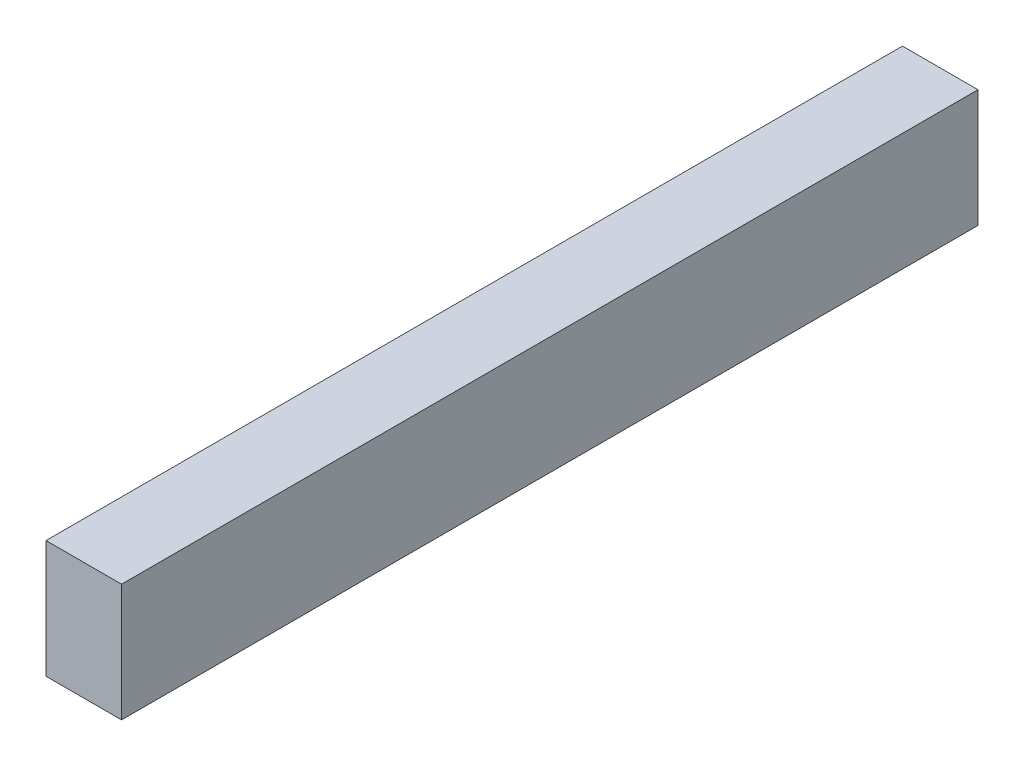
ISO-10303-21;
HEADER;
FILE_DESCRIPTION(('STEP AP214'),'2;1');
FILE_NAME('part.step','',(''),(''),'','','');
FILE_SCHEMA(('AUTOMOTIVE_DESIGN { 1 0 10303 214 1 1 1 1 }'));
ENDSEC;
DATA;
#1=APPLICATION_CONTEXT('core data for automotive mechanical design processes');
#2=APPLICATION_PROTOCOL_DEFINITION('international standard','automotive_design',2000,#1);
#3=PRODUCT_CONTEXT('',#1,'mechanical');
#4=PRODUCT('Part','Part','',(#3));
#5=PRODUCT_RELATED_PRODUCT_CATEGORY('part','',(#4));
#6=PRODUCT_DEFINITION_FORMATION('','',#4);
#7=PRODUCT_DEFINITION_CONTEXT('part definition',#1,'design');
#8=PRODUCT_DEFINITION('design','',#6,#7);
#9=PRODUCT_DEFINITION_SHAPE('','',#8);
#10=(LENGTH_UNIT() NAMED_UNIT(*) SI_UNIT(.MILLI.,.METRE.));
#11=(NAMED_UNIT(*) PLANE_ANGLE_UNIT() SI_UNIT($,.RADIAN.));
#12=(NAMED_UNIT(*) SI_UNIT($,.STERADIAN.) SOLID_ANGLE_UNIT());
#13=UNCERTAINTY_MEASURE_WITH_UNIT(LENGTH_MEASURE(1.E-05),#10,'distance_accuracy_value','');
#14=(GEOMETRIC_REPRESENTATION_CONTEXT(3) GLOBAL_UNCERTAINTY_ASSIGNED_CONTEXT((#13)) GLOBAL_UNIT_ASSIGNED_CONTEXT((#10,
#11,#12)) REPRESENTATION_CONTEXT('',''));
#15=CARTESIAN_POINT('',(0.,0.,0.));
#16=DIRECTION('',(0.,0.,1.));
#17=DIRECTION('',(1.,0.,0.));
#18=AXIS2_PLACEMENT_3D('',#15,#16,#17);
#19=CARTESIAN_POINT('',(0.,0.,510.));
#20=DIRECTION('',(1.,0.,0.));
#21=DIRECTION('',(0.,1.,0.));
#22=AXIS2_PLACEMENT_3D('',#19,#20,#21);
#23=PLANE('',#22);
#24=DIRECTION('',(0.,-1.,0.));
#25=VECTOR('',#24,1.);
#26=CARTESIAN_POINT('',(0.,0.,0.));
#27=LINE('',#26,#25);
#28=CARTESIAN_POINT('',(0.,0.,0.));
#29=VERTEX_POINT('',#28);
#30=CARTESIAN_POINT('',(0.,-70.,0.));
#31=VERTEX_POINT('',#30);
#32=EDGE_CURVE('E96',#29,#31,#27,.T.);
#33=ORIENTED_EDGE('',*,*,#32,.T.);
#34=DIRECTION('',(0.,0.,-1.));
#35=VECTOR('',#34,1.);
#36=CARTESIAN_POINT('',(0.,-70.,510.));
#37=LINE('',#36,#35);
#38=CARTESIAN_POINT('',(0.,-70.,510.));
#39=VERTEX_POINT('',#38);
#40=EDGE_CURVE('E11',#39,#31,#37,.T.);
#41=ORIENTED_EDGE('',*,*,#40,.F.);
#42=DIRECTION('',(0.,-1.,0.));
#43=VECTOR('',#42,1.);
#44=CARTESIAN_POINT('',(0.,0.,510.));
#45=LINE('',#44,#43);
#46=CARTESIAN_POINT('',(0.,0.,510.));
#47=VERTEX_POINT('',#46);
#48=EDGE_CURVE('E84',#47,#39,#45,.T.);
#49=ORIENTED_EDGE('',*,*,#48,.F.);
#50=DIRECTION('',(0.,0.,-1.));
#51=VECTOR('',#50,1.);
#52=CARTESIAN_POINT('',(0.,0.,510.));
#53=LINE('',#52,#51);
#54=EDGE_CURVE('E92',#47,#29,#53,.T.);
#55=ORIENTED_EDGE('',*,*,#54,.T.);
#56=EDGE_LOOP('',(#33,#41,#49,#55));
#57=FACE_BOUND('',#56,.T.);
#58=ADVANCED_FACE('F33',(#57),#23,.F.);
#59=CARTESIAN_POINT('',(0.,-70.,510.));
#60=DIRECTION('',(0.,1.,0.));
#61=DIRECTION('',(0.,0.,1.));
#62=AXIS2_PLACEMENT_3D('',#59,#60,#61);
#63=PLANE('',#62);
#64=DIRECTION('',(1.,0.,0.));
#65=VECTOR('',#64,1.);
#66=CARTESIAN_POINT('',(0.,-70.,0.));
#67=LINE('',#66,#65);
#68=CARTESIAN_POINT('',(45.,-70.,0.));
#69=VERTEX_POINT('',#68);
#70=EDGE_CURVE('E88',#31,#69,#67,.T.);
#71=ORIENTED_EDGE('',*,*,#70,.T.);
#72=DIRECTION('',(0.,0.,-1.));
#73=VECTOR('',#72,1.);
#74=CARTESIAN_POINT('',(45.,-70.,510.));
#75=LINE('',#74,#73);
#76=CARTESIAN_POINT('',(45.,-70.,510.));
#77=VERTEX_POINT('',#76);
#78=EDGE_CURVE('E41',#77,#69,#75,.T.);
#79=ORIENTED_EDGE('',*,*,#78,.F.);
#80=DIRECTION('',(1.,0.,0.));
#81=VECTOR('',#80,1.);
#82=CARTESIAN_POINT('',(0.,-70.,510.));
#83=LINE('',#82,#81);
#84=EDGE_CURVE('E79',#39,#77,#83,.T.);
#85=ORIENTED_EDGE('',*,*,#84,.F.);
#86=ORIENTED_EDGE('',*,*,#40,.T.);
#87=EDGE_LOOP('',(#71,#79,#85,#86));
#88=FACE_BOUND('',#87,.T.);
#89=ADVANCED_FACE('F87',(#88),#63,.F.);
#90=CARTESIAN_POINT('',(45.,0.,510.));
#91=DIRECTION('',(-1.,0.,0.));
#92=DIRECTION('',(0.,-1.,0.));
#93=AXIS2_PLACEMENT_3D('',#90,#91,#92);
#94=PLANE('',#93);
#95=DIRECTION('',(0.,1.,0.));
#96=VECTOR('',#95,1.);
#97=CARTESIAN_POINT('',(45.,0.,0.));
#98=LINE('',#97,#96);
#99=CARTESIAN_POINT('',(45.,0.,0.));
#100=VERTEX_POINT('',#99);
#101=EDGE_CURVE('E66',#69,#100,#98,.T.);
#102=ORIENTED_EDGE('',*,*,#101,.T.);
#103=DIRECTION('',(0.,0.,-1.));
#104=VECTOR('',#103,1.);
#105=CARTESIAN_POINT('',(45.,0.,510.));
#106=LINE('',#105,#104);
#107=CARTESIAN_POINT('',(45.,0.,510.));
#108=VERTEX_POINT('',#107);
#109=EDGE_CURVE('E89',#108,#100,#106,.T.);
#110=ORIENTED_EDGE('',*,*,#109,.F.);
#111=DIRECTION('',(0.,1.,0.));
#112=VECTOR('',#111,1.);
#113=CARTESIAN_POINT('',(45.,0.,510.));
#114=LINE('',#113,#112);
#115=EDGE_CURVE('E82',#77,#108,#114,.T.);
#116=ORIENTED_EDGE('',*,*,#115,.F.);
#117=ORIENTED_EDGE('',*,*,#78,.T.);
#118=EDGE_LOOP('',(#102,#110,#116,#117));
#119=FACE_BOUND('',#118,.T.);
#120=ADVANCED_FACE('F90',(#119),#94,.F.);
#121=CARTESIAN_POINT('',(0.,0.,510.));
#122=DIRECTION('',(0.,-1.,0.));
#123=DIRECTION('',(0.,0.,-1.));
#124=AXIS2_PLACEMENT_3D('',#121,#122,#123);
#125=PLANE('',#124);
#126=DIRECTION('',(-1.,0.,0.));
#127=VECTOR('',#126,1.);
#128=CARTESIAN_POINT('',(0.,0.,0.));
#129=LINE('',#128,#127);
#130=EDGE_CURVE('E72',#100,#29,#129,.T.);
#131=ORIENTED_EDGE('',*,*,#130,.T.);
#132=ORIENTED_EDGE('',*,*,#54,.F.);
#133=DIRECTION('',(-1.,0.,0.));
#134=VECTOR('',#133,1.);
#135=CARTESIAN_POINT('',(0.,0.,510.));
#136=LINE('',#135,#134);
#137=EDGE_CURVE('E49',#108,#47,#136,.T.);
#138=ORIENTED_EDGE('',*,*,#137,.F.);
#139=ORIENTED_EDGE('',*,*,#109,.T.);
#140=EDGE_LOOP('',(#131,#132,#138,#139));
#141=FACE_BOUND('',#140,.T.);
#142=ADVANCED_FACE('F103',(#141),#125,.F.);
#143=CARTESIAN_POINT('',(0.,0.,510.));
#144=DIRECTION('',(0.,0.,1.));
#145=DIRECTION('',(1.,0.,0.));
#146=AXIS2_PLACEMENT_3D('',#143,#144,#145);
#147=PLANE('',#146);
#148=ORIENTED_EDGE('',*,*,#48,.T.);
#149=ORIENTED_EDGE('',*,*,#84,.T.);
#150=ORIENTED_EDGE('',*,*,#115,.T.);
#151=ORIENTED_EDGE('',*,*,#137,.T.);
#152=EDGE_LOOP('',(#148,#149,#150,#151));
#153=FACE_BOUND('',#152,.T.);
#154=ADVANCED_FACE('F80',(#153),#147,.T.);
#155=CARTESIAN_POINT('',(0.,0.,0.));
#156=DIRECTION('',(0.,0.,1.));
#157=DIRECTION('',(1.,0.,0.));
#158=AXIS2_PLACEMENT_3D('',#155,#156,#157);
#159=PLANE('',#158);
#160=ORIENTED_EDGE('',*,*,#32,.F.);
#161=ORIENTED_EDGE('',*,*,#130,.F.);
#162=ORIENTED_EDGE('',*,*,#101,.F.);
#163=ORIENTED_EDGE('',*,*,#70,.F.);
#164=EDGE_LOOP('',(#160,#161,#162,#163));
#165=FACE_BOUND('',#164,.T.);
#166=ADVANCED_FACE('F106',(#165),#159,.F.);
#167=CLOSED_SHELL('',(#58,#89,#120,#142,#154,#166));
#168=MANIFOLD_SOLID_BREP('B2',#167);
#169=ADVANCED_BREP_SHAPE_REPRESENTATION('',(#18,#168),#14);
#170=SHAPE_DEFINITION_REPRESENTATION(#9,#169);
ENDSEC;
END-ISO-10303-21;
